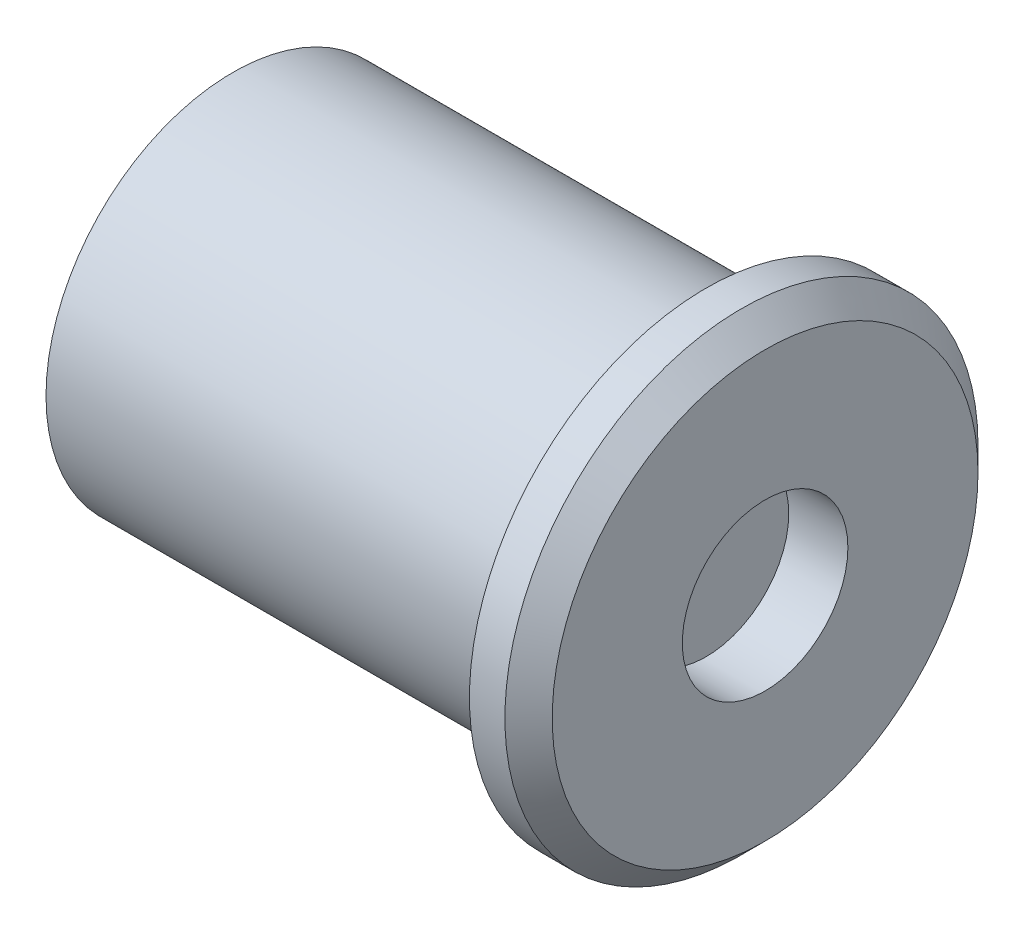
ISO-10303-21;
HEADER;
FILE_DESCRIPTION(('STEP AP214'),'2;1');
FILE_NAME('part.step','',(''),(''),'','','');
FILE_SCHEMA(('AUTOMOTIVE_DESIGN { 1 0 10303 214 1 1 1 1 }'));
ENDSEC;
DATA;
#1=APPLICATION_CONTEXT('core data for automotive mechanical design processes');
#2=APPLICATION_PROTOCOL_DEFINITION('international standard','automotive_design',2000,#1);
#3=PRODUCT_CONTEXT('',#1,'mechanical');
#4=PRODUCT('Part','Part','',(#3));
#5=PRODUCT_RELATED_PRODUCT_CATEGORY('part','',(#4));
#6=PRODUCT_DEFINITION_FORMATION('','',#4);
#7=PRODUCT_DEFINITION_CONTEXT('part definition',#1,'design');
#8=PRODUCT_DEFINITION('design','',#6,#7);
#9=PRODUCT_DEFINITION_SHAPE('','',#8);
#10=(LENGTH_UNIT() NAMED_UNIT(*) SI_UNIT(.MILLI.,.METRE.));
#11=(NAMED_UNIT(*) PLANE_ANGLE_UNIT() SI_UNIT($,.RADIAN.));
#12=(NAMED_UNIT(*) SI_UNIT($,.STERADIAN.) SOLID_ANGLE_UNIT());
#13=UNCERTAINTY_MEASURE_WITH_UNIT(LENGTH_MEASURE(1.E-05),#10,'distance_accuracy_value','');
#14=(GEOMETRIC_REPRESENTATION_CONTEXT(3) GLOBAL_UNCERTAINTY_ASSIGNED_CONTEXT((#13)) GLOBAL_UNIT_ASSIGNED_CONTEXT((#10,
#11,#12)) REPRESENTATION_CONTEXT('',''));
#15=CARTESIAN_POINT('',(0.,0.,0.));
#16=DIRECTION('',(0.,0.,1.));
#17=DIRECTION('',(1.,0.,0.));
#18=AXIS2_PLACEMENT_3D('',#15,#16,#17);
#19=CARTESIAN_POINT('',(-20.,0.,0.));
#20=DIRECTION('',(1.,0.,0.));
#21=DIRECTION('',(0.,0.,-1.));
#22=AXIS2_PLACEMENT_3D('',#19,#20,#21);
#23=CYLINDRICAL_SURFACE('',#22,7.9);
#24=CARTESIAN_POINT('',(-20.,0.,0.));
#25=DIRECTION('',(1.,0.,0.));
#26=DIRECTION('',(0.,0.,-1.));
#27=AXIS2_PLACEMENT_3D('',#24,#25,#26);
#28=CIRCLE('',#27,7.9);
#29=CARTESIAN_POINT('',(-20.,0.,-7.9));
#30=VERTEX_POINT('',#29);
#31=EDGE_CURVE('E49',#30,#30,#28,.T.);
#32=ORIENTED_EDGE('',*,*,#31,.T.);
#33=EDGE_LOOP('',(#32));
#34=FACE_BOUND('',#33,.T.);
#35=CARTESIAN_POINT('',(0.,0.,0.));
#36=DIRECTION('',(1.,0.,0.));
#37=DIRECTION('',(0.,0.,-1.));
#38=AXIS2_PLACEMENT_3D('',#35,#36,#37);
#39=CIRCLE('',#38,7.9);
#40=CARTESIAN_POINT('',(0.,0.,-7.9));
#41=VERTEX_POINT('',#40);
#42=EDGE_CURVE('E53',#41,#41,#39,.T.);
#43=ORIENTED_EDGE('',*,*,#42,.F.);
#44=EDGE_LOOP('',(#43));
#45=FACE_BOUND('',#44,.T.);
#46=ADVANCED_FACE('F37',(#34,#45),#23,.T.);
#47=CARTESIAN_POINT('',(-20.,0.,0.));
#48=DIRECTION('',(1.,0.,0.));
#49=DIRECTION('',(0.,0.,-1.));
#50=AXIS2_PLACEMENT_3D('',#47,#48,#49);
#51=PLANE('',#50);
#52=ORIENTED_EDGE('',*,*,#31,.F.);
#53=EDGE_LOOP('',(#52));
#54=FACE_BOUND('',#53,.T.);
#55=ADVANCED_FACE('F87',(#54),#51,.F.);
#56=CARTESIAN_POINT('',(2.5,0.,0.));
#57=DIRECTION('',(-1.,0.,0.));
#58=DIRECTION('',(0.,0.,1.));
#59=AXIS2_PLACEMENT_3D('',#56,#57,#58);
#60=CYLINDRICAL_SURFACE('',#59,10.);
#61=CARTESIAN_POINT('',(1.49999999999999,0.,0.));
#62=DIRECTION('',(1.,0.,0.));
#63=DIRECTION('',(0.,0.,-1.));
#64=AXIS2_PLACEMENT_3D('',#61,#62,#63);
#65=CIRCLE('',#64,10.);
#66=CARTESIAN_POINT('',(1.49999999999999,0.,-10.));
#67=VERTEX_POINT('',#66);
#68=EDGE_CURVE('E10',#67,#67,#65,.F.);
#69=ORIENTED_EDGE('',*,*,#68,.T.);
#70=EDGE_LOOP('',(#69));
#71=FACE_BOUND('',#70,.T.);
#72=CARTESIAN_POINT('',(0.,0.,0.));
#73=DIRECTION('',(1.,0.,0.));
#74=DIRECTION('',(0.,0.,-1.));
#75=AXIS2_PLACEMENT_3D('',#72,#73,#74);
#76=CIRCLE('',#75,10.);
#77=CARTESIAN_POINT('',(0.,0.,-10.));
#78=VERTEX_POINT('',#77);
#79=EDGE_CURVE('E57',#78,#78,#76,.T.);
#80=ORIENTED_EDGE('',*,*,#79,.T.);
#81=EDGE_LOOP('',(#80));
#82=FACE_BOUND('',#81,.T.);
#83=ADVANCED_FACE('F79',(#71,#82),#60,.T.);
#84=CARTESIAN_POINT('',(2.5,0.,0.));
#85=DIRECTION('',(1.,0.,0.));
#86=DIRECTION('',(0.,0.,-1.));
#87=AXIS2_PLACEMENT_3D('',#84,#85,#86);
#88=PLANE('',#87);
#89=CARTESIAN_POINT('',(2.5,0.,0.));
#90=DIRECTION('',(1.,0.,0.));
#91=DIRECTION('',(0.,0.,-1.));
#92=AXIS2_PLACEMENT_3D('',#89,#90,#91);
#93=CIRCLE('',#92,8.99999999999999);
#94=CARTESIAN_POINT('',(2.5,0.,-8.99999999999999));
#95=VERTEX_POINT('',#94);
#96=EDGE_CURVE('E45',#95,#95,#93,.T.);
#97=ORIENTED_EDGE('',*,*,#96,.T.);
#98=EDGE_LOOP('',(#97));
#99=FACE_BOUND('',#98,.T.);
#100=CARTESIAN_POINT('',(2.5,0.,0.));
#101=DIRECTION('',(1.,0.,0.));
#102=DIRECTION('',(0.,0.,-1.));
#103=AXIS2_PLACEMENT_3D('',#100,#101,#102);
#104=CIRCLE('',#103,3.5);
#105=CARTESIAN_POINT('',(2.5,0.,-3.5));
#106=VERTEX_POINT('',#105);
#107=EDGE_CURVE('E62',#106,#106,#104,.T.);
#108=ORIENTED_EDGE('',*,*,#107,.F.);
#109=EDGE_LOOP('',(#108));
#110=FACE_BOUND('',#109,.T.);
#111=ADVANCED_FACE('F77',(#99,#110),#88,.T.);
#112=CARTESIAN_POINT('',(0.,0.,0.));
#113=DIRECTION('',(1.,0.,0.));
#114=DIRECTION('',(0.,0.,-1.));
#115=AXIS2_PLACEMENT_3D('',#112,#113,#114);
#116=PLANE('',#115);
#117=ORIENTED_EDGE('',*,*,#42,.T.);
#118=EDGE_LOOP('',(#117));
#119=FACE_BOUND('',#118,.T.);
#120=ORIENTED_EDGE('',*,*,#79,.F.);
#121=EDGE_LOOP('',(#120));
#122=FACE_BOUND('',#121,.T.);
#123=ADVANCED_FACE('F73',(#119,#122),#116,.F.);
#124=CARTESIAN_POINT('',(0.,0.,0.));
#125=DIRECTION('',(1.,0.,0.));
#126=DIRECTION('',(0.,0.,-1.));
#127=AXIS2_PLACEMENT_3D('',#124,#125,#126);
#128=CYLINDRICAL_SURFACE('',#127,3.5);
#129=CARTESIAN_POINT('',(0.,0.,0.));
#130=DIRECTION('',(1.,0.,0.));
#131=DIRECTION('',(0.,0.,-1.));
#132=AXIS2_PLACEMENT_3D('',#129,#130,#131);
#133=CIRCLE('',#132,3.5);
#134=CARTESIAN_POINT('',(0.,0.,-3.5));
#135=VERTEX_POINT('',#134);
#136=EDGE_CURVE('E61',#135,#135,#133,.T.);
#137=ORIENTED_EDGE('',*,*,#136,.F.);
#138=EDGE_LOOP('',(#137));
#139=FACE_BOUND('',#138,.T.);
#140=ORIENTED_EDGE('',*,*,#107,.T.);
#141=EDGE_LOOP('',(#140));
#142=FACE_BOUND('',#141,.T.);
#143=ADVANCED_FACE('F70',(#139,#142),#128,.F.);
#144=CARTESIAN_POINT('',(0.,0.,0.));
#145=DIRECTION('',(1.,0.,0.));
#146=DIRECTION('',(0.,0.,-1.));
#147=AXIS2_PLACEMENT_3D('',#144,#145,#146);
#148=PLANE('',#147);
#149=ORIENTED_EDGE('',*,*,#136,.T.);
#150=EDGE_LOOP('',(#149));
#151=FACE_BOUND('',#150,.T.);
#152=ADVANCED_FACE('F68',(#151),#148,.T.);
#153=CARTESIAN_POINT('',(2.5,0.,0.));
#154=DIRECTION('',(-1.,0.,0.));
#155=DIRECTION('',(0.,0.,1.));
#156=AXIS2_PLACEMENT_3D('',#153,#154,#155);
#157=CONICAL_SURFACE('',#156,8.99999999999999,0.785398163397448);
#158=ORIENTED_EDGE('',*,*,#68,.F.);
#159=EDGE_LOOP('',(#158));
#160=FACE_BOUND('',#159,.T.);
#161=ORIENTED_EDGE('',*,*,#96,.F.);
#162=EDGE_LOOP('',(#161));
#163=FACE_BOUND('',#162,.T.);
#164=ADVANCED_FACE('F40',(#160,#163),#157,.T.);
#165=CLOSED_SHELL('',(#46,#55,#83,#111,#123,#143,#152,#164));
#166=MANIFOLD_SOLID_BREP('B2',#165);
#167=ADVANCED_BREP_SHAPE_REPRESENTATION('',(#18,#166),#14);
#168=SHAPE_DEFINITION_REPRESENTATION(#9,#167);
ENDSEC;
END-ISO-10303-21;
